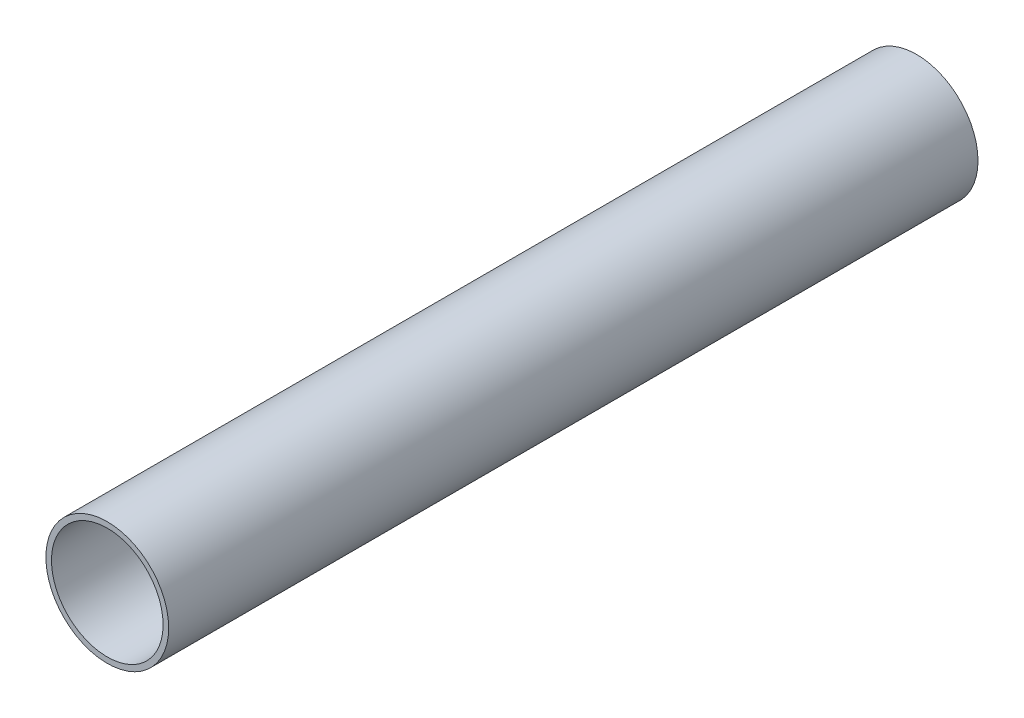
ISO-10303-21;
HEADER;
FILE_DESCRIPTION(('STEP AP214'),'2;1');
FILE_NAME('part.step','',(''),(''),'','','');
FILE_SCHEMA(('AUTOMOTIVE_DESIGN { 1 0 10303 214 1 1 1 1 }'));
ENDSEC;
DATA;
#1=APPLICATION_CONTEXT('core data for automotive mechanical design processes');
#2=APPLICATION_PROTOCOL_DEFINITION('international standard','automotive_design',2000,#1);
#3=PRODUCT_CONTEXT('',#1,'mechanical');
#4=PRODUCT('Part','Part','',(#3));
#5=PRODUCT_RELATED_PRODUCT_CATEGORY('part','',(#4));
#6=PRODUCT_DEFINITION_FORMATION('','',#4);
#7=PRODUCT_DEFINITION_CONTEXT('part definition',#1,'design');
#8=PRODUCT_DEFINITION('design','',#6,#7);
#9=PRODUCT_DEFINITION_SHAPE('','',#8);
#10=(LENGTH_UNIT() NAMED_UNIT(*) SI_UNIT(.MILLI.,.METRE.));
#11=(NAMED_UNIT(*) PLANE_ANGLE_UNIT() SI_UNIT($,.RADIAN.));
#12=(NAMED_UNIT(*) SI_UNIT($,.STERADIAN.) SOLID_ANGLE_UNIT());
#13=UNCERTAINTY_MEASURE_WITH_UNIT(LENGTH_MEASURE(1.E-05),#10,'distance_accuracy_value','');
#14=(GEOMETRIC_REPRESENTATION_CONTEXT(3) GLOBAL_UNCERTAINTY_ASSIGNED_CONTEXT((#13)) GLOBAL_UNIT_ASSIGNED_CONTEXT((#10,
#11,#12)) REPRESENTATION_CONTEXT('',''));
#15=CARTESIAN_POINT('',(0.,0.,0.));
#16=DIRECTION('',(0.,0.,1.));
#17=DIRECTION('',(1.,0.,0.));
#18=AXIS2_PLACEMENT_3D('',#15,#16,#17);
#19=CARTESIAN_POINT('',(0.,0.,145.));
#20=DIRECTION('',(0.,0.,1.));
#21=DIRECTION('',(1.,0.,0.));
#22=AXIS2_PLACEMENT_3D('',#19,#20,#21);
#23=PLANE('',#22);
#24=CARTESIAN_POINT('',(0.,0.,145.));
#25=DIRECTION('',(0.,0.,1.));
#26=DIRECTION('',(1.,0.,0.));
#27=AXIS2_PLACEMENT_3D('',#24,#25,#26);
#28=CIRCLE('',#27,11.);
#29=CARTESIAN_POINT('',(11.,0.,145.));
#30=VERTEX_POINT('',#29);
#31=EDGE_CURVE('E10',#30,#30,#28,.T.);
#32=ORIENTED_EDGE('',*,*,#31,.T.);
#33=EDGE_LOOP('',(#32));
#34=FACE_BOUND('',#33,.T.);
#35=CARTESIAN_POINT('',(0.,0.,145.));
#36=DIRECTION('',(0.,0.,1.));
#37=DIRECTION('',(1.,0.,0.));
#38=AXIS2_PLACEMENT_3D('',#35,#36,#37);
#39=CIRCLE('',#38,10.);
#40=CARTESIAN_POINT('',(10.,0.,145.));
#41=VERTEX_POINT('',#40);
#42=EDGE_CURVE('E44',#41,#41,#39,.T.);
#43=ORIENTED_EDGE('',*,*,#42,.F.);
#44=EDGE_LOOP('',(#43));
#45=FACE_BOUND('',#44,.T.);
#46=ADVANCED_FACE('F33',(#34,#45),#23,.T.);
#47=CARTESIAN_POINT('',(0.,0.,0.));
#48=DIRECTION('',(0.,0.,1.));
#49=DIRECTION('',(1.,0.,0.));
#50=AXIS2_PLACEMENT_3D('',#47,#48,#49);
#51=PLANE('',#50);
#52=CARTESIAN_POINT('',(0.,0.,0.));
#53=DIRECTION('',(0.,0.,1.));
#54=DIRECTION('',(1.,0.,0.));
#55=AXIS2_PLACEMENT_3D('',#52,#53,#54);
#56=CIRCLE('',#55,11.);
#57=CARTESIAN_POINT('',(11.,0.,0.));
#58=VERTEX_POINT('',#57);
#59=EDGE_CURVE('E37',#58,#58,#56,.T.);
#60=ORIENTED_EDGE('',*,*,#59,.F.);
#61=EDGE_LOOP('',(#60));
#62=FACE_BOUND('',#61,.T.);
#63=CARTESIAN_POINT('',(0.,0.,0.));
#64=DIRECTION('',(0.,0.,1.));
#65=DIRECTION('',(1.,0.,0.));
#66=AXIS2_PLACEMENT_3D('',#63,#64,#65);
#67=CIRCLE('',#66,10.);
#68=CARTESIAN_POINT('',(10.,0.,0.));
#69=VERTEX_POINT('',#68);
#70=EDGE_CURVE('E46',#69,#69,#67,.T.);
#71=ORIENTED_EDGE('',*,*,#70,.T.);
#72=EDGE_LOOP('',(#71));
#73=FACE_BOUND('',#72,.T.);
#74=ADVANCED_FACE('F56',(#62,#73),#51,.F.);
#75=CARTESIAN_POINT('',(0.,0.,145.));
#76=DIRECTION('',(0.,0.,-1.));
#77=DIRECTION('',(-1.,0.,0.));
#78=AXIS2_PLACEMENT_3D('',#75,#76,#77);
#79=CYLINDRICAL_SURFACE('',#78,11.);
#80=ORIENTED_EDGE('',*,*,#31,.F.);
#81=EDGE_LOOP('',(#80));
#82=FACE_BOUND('',#81,.T.);
#83=ORIENTED_EDGE('',*,*,#59,.T.);
#84=EDGE_LOOP('',(#83));
#85=FACE_BOUND('',#84,.T.);
#86=ADVANCED_FACE('F35',(#82,#85),#79,.T.);
#87=CARTESIAN_POINT('',(0.,0.,145.));
#88=DIRECTION('',(0.,0.,-1.));
#89=DIRECTION('',(-1.,0.,0.));
#90=AXIS2_PLACEMENT_3D('',#87,#88,#89);
#91=CYLINDRICAL_SURFACE('',#90,10.);
#92=ORIENTED_EDGE('',*,*,#42,.T.);
#93=EDGE_LOOP('',(#92));
#94=FACE_BOUND('',#93,.T.);
#95=ORIENTED_EDGE('',*,*,#70,.F.);
#96=EDGE_LOOP('',(#95));
#97=FACE_BOUND('',#96,.T.);
#98=ADVANCED_FACE('F52',(#94,#97),#91,.F.);
#99=CLOSED_SHELL('',(#46,#74,#86,#98));
#100=MANIFOLD_SOLID_BREP('B2',#99);
#101=ADVANCED_BREP_SHAPE_REPRESENTATION('',(#18,#100),#14);
#102=SHAPE_DEFINITION_REPRESENTATION(#9,#101);
ENDSEC;
END-ISO-10303-21;
